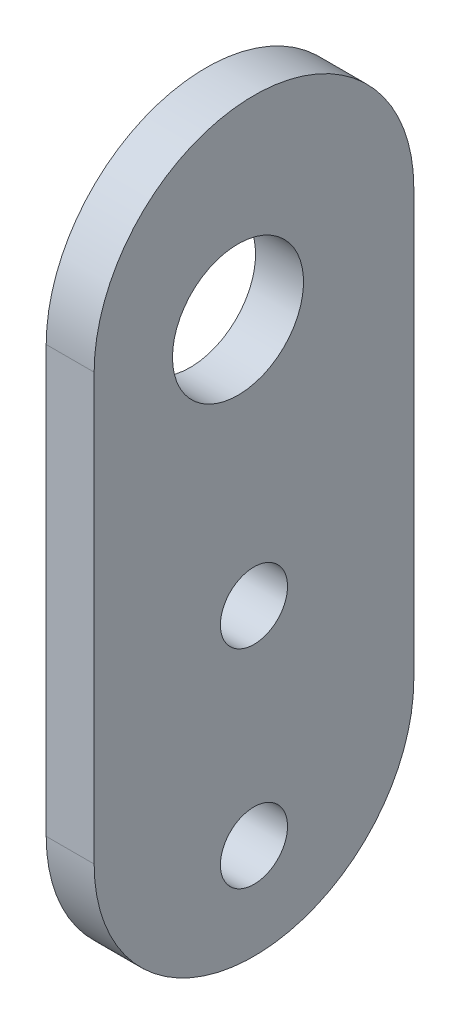
ISO-10303-21;
HEADER;
FILE_DESCRIPTION(('STEP AP214'),'2;1');
FILE_NAME('part.step','',(''),(''),'','','');
FILE_SCHEMA(('AUTOMOTIVE_DESIGN { 1 0 10303 214 1 1 1 1 }'));
ENDSEC;
DATA;
#1=APPLICATION_CONTEXT('core data for automotive mechanical design processes');
#2=APPLICATION_PROTOCOL_DEFINITION('international standard','automotive_design',2000,#1);
#3=PRODUCT_CONTEXT('',#1,'mechanical');
#4=PRODUCT('Part','Part','',(#3));
#5=PRODUCT_RELATED_PRODUCT_CATEGORY('part','',(#4));
#6=PRODUCT_DEFINITION_FORMATION('','',#4);
#7=PRODUCT_DEFINITION_CONTEXT('part definition',#1,'design');
#8=PRODUCT_DEFINITION('design','',#6,#7);
#9=PRODUCT_DEFINITION_SHAPE('','',#8);
#10=(LENGTH_UNIT() NAMED_UNIT(*) SI_UNIT(.MILLI.,.METRE.));
#11=(NAMED_UNIT(*) PLANE_ANGLE_UNIT() SI_UNIT($,.RADIAN.));
#12=(NAMED_UNIT(*) SI_UNIT($,.STERADIAN.) SOLID_ANGLE_UNIT());
#13=UNCERTAINTY_MEASURE_WITH_UNIT(LENGTH_MEASURE(1.E-05),#10,'distance_accuracy_value','');
#14=(GEOMETRIC_REPRESENTATION_CONTEXT(3) GLOBAL_UNCERTAINTY_ASSIGNED_CONTEXT((#13)) GLOBAL_UNIT_ASSIGNED_CONTEXT((#10,
#11,#12)) REPRESENTATION_CONTEXT('',''));
#15=CARTESIAN_POINT('',(0.,0.,0.));
#16=DIRECTION('',(0.,0.,1.));
#17=DIRECTION('',(1.,0.,0.));
#18=AXIS2_PLACEMENT_3D('',#15,#16,#17);
#19=CARTESIAN_POINT('',(-126.55,168.0857476665,139.));
#20=DIRECTION('',(1.,0.,0.));
#21=DIRECTION('',(0.,0.,-1.));
#22=AXIS2_PLACEMENT_3D('',#19,#20,#21);
#23=PLANE('',#22);
#24=CARTESIAN_POINT('',(-126.55,119.0857476665,138.));
#25=DIRECTION('',(-1.,0.,0.));
#26=DIRECTION('',(0.,0.,1.));
#27=AXIS2_PLACEMENT_3D('',#24,#25,#26);
#28=CIRCLE('',#27,2.09999999999999);
#29=CARTESIAN_POINT('',(-126.55,119.0857476665,140.1));
#30=VERTEX_POINT('',#29);
#31=EDGE_CURVE('E94',#30,#30,#28,.F.);
#32=ORIENTED_EDGE('',*,*,#31,.T.);
#33=EDGE_LOOP('',(#32));
#34=FACE_BOUND('',#33,.T.);
#35=CARTESIAN_POINT('',(-126.55,132.0857476665,138.));
#36=DIRECTION('',(-1.,0.,0.));
#37=DIRECTION('',(0.,0.,1.));
#38=AXIS2_PLACEMENT_3D('',#35,#36,#37);
#39=CIRCLE('',#38,2.09999999999999);
#40=CARTESIAN_POINT('',(-126.55,132.0857476665,140.1));
#41=VERTEX_POINT('',#40);
#42=EDGE_CURVE('E97',#41,#41,#39,.F.);
#43=ORIENTED_EDGE('',*,*,#42,.T.);
#44=EDGE_LOOP('',(#43));
#45=FACE_BOUND('',#44,.T.);
#46=CARTESIAN_POINT('',(-126.55,148.0857476665,139.));
#47=DIRECTION('',(-1.,0.,0.));
#48=DIRECTION('',(0.,0.,1.));
#49=AXIS2_PLACEMENT_3D('',#46,#47,#48);
#50=CIRCLE('',#49,4.09999999999999);
#51=CARTESIAN_POINT('',(-126.55,148.0857476665,143.1));
#52=VERTEX_POINT('',#51);
#53=EDGE_CURVE('E70',#52,#52,#50,.F.);
#54=ORIENTED_EDGE('',*,*,#53,.T.);
#55=EDGE_LOOP('',(#54));
#56=FACE_BOUND('',#55,.T.);
#57=DIRECTION('',(0.,1.,0.));
#58=VECTOR('',#57,1.);
#59=CARTESIAN_POINT('',(-126.55,195.9043807818,128.));
#60=LINE('',#59,#58);
#61=CARTESIAN_POINT('',(-126.55,149.7357476665,128.));
#62=VERTEX_POINT('',#61);
#63=CARTESIAN_POINT('',(-126.55,123.0857476665,128.));
#64=VERTEX_POINT('',#63);
#65=EDGE_CURVE('E58',#62,#64,#60,.F.);
#66=ORIENTED_EDGE('',*,*,#65,.T.);
#67=CARTESIAN_POINT('',(-126.55,123.0857476665,138.));
#68=DIRECTION('',(1.,0.,0.));
#69=DIRECTION('',(0.,0.,-1.));
#70=AXIS2_PLACEMENT_3D('',#67,#68,#69);
#71=CIRCLE('',#70,10.);
#72=CARTESIAN_POINT('',(-126.55,123.0857476665,148.));
#73=VERTEX_POINT('',#72);
#74=EDGE_CURVE('E77',#73,#64,#71,.T.);
#75=ORIENTED_EDGE('',*,*,#74,.F.);
#76=DIRECTION('',(0.,1.,0.));
#77=VECTOR('',#76,1.);
#78=CARTESIAN_POINT('',(-126.55,107.4054732291,148.));
#79=LINE('',#78,#77);
#80=CARTESIAN_POINT('',(-126.55,149.7357476665,148.));
#81=VERTEX_POINT('',#80);
#82=EDGE_CURVE('E60',#73,#81,#79,.T.);
#83=ORIENTED_EDGE('',*,*,#82,.T.);
#84=CARTESIAN_POINT('',(-126.55,149.7357476665,138.));
#85=DIRECTION('',(-1.,0.,0.));
#86=DIRECTION('',(0.,0.,1.));
#87=AXIS2_PLACEMENT_3D('',#84,#85,#86);
#88=CIRCLE('',#87,10.);
#89=EDGE_CURVE('E20',#62,#81,#88,.F.);
#90=ORIENTED_EDGE('',*,*,#89,.F.);
#91=EDGE_LOOP('',(#66,#75,#83,#90));
#92=FACE_BOUND('',#91,.T.);
#93=ADVANCED_FACE('F17',(#34,#45,#56,#92),#23,.F.);
#94=CARTESIAN_POINT('',(-117.032,149.7357476665,138.));
#95=DIRECTION('',(-1.,0.,0.));
#96=DIRECTION('',(0.,0.,1.));
#97=AXIS2_PLACEMENT_3D('',#94,#95,#96);
#98=CYLINDRICAL_SURFACE('',#97,10.);
#99=ORIENTED_EDGE('',*,*,#89,.T.);
#100=DIRECTION('',(-1.,0.,0.));
#101=VECTOR('',#100,1.);
#102=CARTESIAN_POINT('',(-123.55,149.7357476665,148.));
#103=LINE('',#102,#101);
#104=CARTESIAN_POINT('',(-123.55,149.7357476665,148.));
#105=VERTEX_POINT('',#104);
#106=EDGE_CURVE('E81',#81,#105,#103,.F.);
#107=ORIENTED_EDGE('',*,*,#106,.T.);
#108=CARTESIAN_POINT('',(-123.55,149.7357476665,138.));
#109=DIRECTION('',(-1.,0.,0.));
#110=DIRECTION('',(0.,0.,1.));
#111=AXIS2_PLACEMENT_3D('',#108,#109,#110);
#112=CIRCLE('',#111,10.);
#113=CARTESIAN_POINT('',(-123.55,149.7357476665,128.));
#114=VERTEX_POINT('',#113);
#115=EDGE_CURVE('E67',#114,#105,#112,.F.);
#116=ORIENTED_EDGE('',*,*,#115,.F.);
#117=DIRECTION('',(1.,0.,0.));
#118=VECTOR('',#117,1.);
#119=CARTESIAN_POINT('',(-123.55,149.7357476665,128.));
#120=LINE('',#119,#118);
#121=EDGE_CURVE('E64',#114,#62,#120,.F.);
#122=ORIENTED_EDGE('',*,*,#121,.T.);
#123=EDGE_LOOP('',(#99,#107,#116,#122));
#124=FACE_BOUND('',#123,.T.);
#125=ADVANCED_FACE('F65',(#124),#98,.T.);
#126=CARTESIAN_POINT('',(-123.55,107.4054732291,148.));
#127=DIRECTION('',(0.,0.,-1.));
#128=DIRECTION('',(-1.,0.,0.));
#129=AXIS2_PLACEMENT_3D('',#126,#127,#128);
#130=PLANE('',#129);
#131=ORIENTED_EDGE('',*,*,#82,.F.);
#132=DIRECTION('',(1.,0.,0.));
#133=VECTOR('',#132,1.);
#134=CARTESIAN_POINT('',(-135.068,123.0857476665,148.));
#135=LINE('',#134,#133);
#136=CARTESIAN_POINT('',(-123.55,123.0857476665,148.));
#137=VERTEX_POINT('',#136);
#138=EDGE_CURVE('E73',#137,#73,#135,.F.);
#139=ORIENTED_EDGE('',*,*,#138,.F.);
#140=DIRECTION('',(0.,1.,0.));
#141=VECTOR('',#140,1.);
#142=CARTESIAN_POINT('',(-123.55,168.0857476665,148.));
#143=LINE('',#142,#141);
#144=EDGE_CURVE('E92',#105,#137,#143,.F.);
#145=ORIENTED_EDGE('',*,*,#144,.F.);
#146=ORIENTED_EDGE('',*,*,#106,.F.);
#147=EDGE_LOOP('',(#131,#139,#145,#146));
#148=FACE_BOUND('',#147,.T.);
#149=ADVANCED_FACE('F104',(#148),#130,.F.);
#150=CARTESIAN_POINT('',(-135.068,123.0857476665,138.));
#151=DIRECTION('',(1.,0.,0.));
#152=DIRECTION('',(0.,0.,-1.));
#153=AXIS2_PLACEMENT_3D('',#150,#151,#152);
#154=CYLINDRICAL_SURFACE('',#153,10.);
#155=CARTESIAN_POINT('',(-123.55,123.0857476665,138.));
#156=DIRECTION('',(1.,0.,0.));
#157=DIRECTION('',(0.,0.,-1.));
#158=AXIS2_PLACEMENT_3D('',#155,#156,#157);
#159=CIRCLE('',#158,10.);
#160=CARTESIAN_POINT('',(-123.55,123.0857476665,128.));
#161=VERTEX_POINT('',#160);
#162=EDGE_CURVE('E89',#137,#161,#159,.T.);
#163=ORIENTED_EDGE('',*,*,#162,.F.);
#164=ORIENTED_EDGE('',*,*,#138,.T.);
#165=ORIENTED_EDGE('',*,*,#74,.T.);
#166=DIRECTION('',(1.,0.,0.));
#167=VECTOR('',#166,1.);
#168=CARTESIAN_POINT('',(-123.55,123.0857476665,128.));
#169=LINE('',#168,#167);
#170=EDGE_CURVE('E35',#64,#161,#169,.T.);
#171=ORIENTED_EDGE('',*,*,#170,.T.);
#172=EDGE_LOOP('',(#163,#164,#165,#171));
#173=FACE_BOUND('',#172,.T.);
#174=ADVANCED_FACE('F109',(#173),#154,.T.);
#175=CARTESIAN_POINT('',(-123.55,195.9043807818,128.));
#176=DIRECTION('',(0.,0.,1.));
#177=DIRECTION('',(1.,0.,0.));
#178=AXIS2_PLACEMENT_3D('',#175,#176,#177);
#179=PLANE('',#178);
#180=DIRECTION('',(0.,1.,0.));
#181=VECTOR('',#180,1.);
#182=CARTESIAN_POINT('',(-123.55,168.0857476665,128.));
#183=LINE('',#182,#181);
#184=EDGE_CURVE('E88',#161,#114,#183,.T.);
#185=ORIENTED_EDGE('',*,*,#184,.F.);
#186=ORIENTED_EDGE('',*,*,#170,.F.);
#187=ORIENTED_EDGE('',*,*,#65,.F.);
#188=ORIENTED_EDGE('',*,*,#121,.F.);
#189=EDGE_LOOP('',(#185,#186,#187,#188));
#190=FACE_BOUND('',#189,.T.);
#191=ADVANCED_FACE('F72',(#190),#179,.F.);
#192=CARTESIAN_POINT('',(-128.55,148.0857476665,139.));
#193=DIRECTION('',(-1.,0.,0.));
#194=DIRECTION('',(0.,0.,1.));
#195=AXIS2_PLACEMENT_3D('',#192,#193,#194);
#196=CYLINDRICAL_SURFACE('',#195,4.09999999999999);
#197=CARTESIAN_POINT('',(-123.55,148.0857476665,139.));
#198=DIRECTION('',(-1.,0.,0.));
#199=DIRECTION('',(0.,0.,1.));
#200=AXIS2_PLACEMENT_3D('',#197,#198,#199);
#201=CIRCLE('',#200,4.09999999999999);
#202=CARTESIAN_POINT('',(-123.55,148.0857476665,143.1));
#203=VERTEX_POINT('',#202);
#204=EDGE_CURVE('E85',#203,#203,#201,.T.);
#205=ORIENTED_EDGE('',*,*,#204,.F.);
#206=EDGE_LOOP('',(#205));
#207=FACE_BOUND('',#206,.T.);
#208=ORIENTED_EDGE('',*,*,#53,.F.);
#209=EDGE_LOOP('',(#208));
#210=FACE_BOUND('',#209,.T.);
#211=ADVANCED_FACE('F117',(#207,#210),#196,.F.);
#212=CARTESIAN_POINT('',(-128.55,132.0857476665,138.));
#213=DIRECTION('',(-1.,0.,0.));
#214=DIRECTION('',(0.,0.,1.));
#215=AXIS2_PLACEMENT_3D('',#212,#213,#214);
#216=CYLINDRICAL_SURFACE('',#215,2.09999999999999);
#217=CARTESIAN_POINT('',(-123.55,132.0857476665,138.));
#218=DIRECTION('',(-1.,0.,0.));
#219=DIRECTION('',(0.,0.,1.));
#220=AXIS2_PLACEMENT_3D('',#217,#218,#219);
#221=CIRCLE('',#220,2.09999999999999);
#222=CARTESIAN_POINT('',(-123.55,132.0857476665,140.1));
#223=VERTEX_POINT('',#222);
#224=EDGE_CURVE('E26',#223,#223,#221,.T.);
#225=ORIENTED_EDGE('',*,*,#224,.F.);
#226=EDGE_LOOP('',(#225));
#227=FACE_BOUND('',#226,.T.);
#228=ORIENTED_EDGE('',*,*,#42,.F.);
#229=EDGE_LOOP('',(#228));
#230=FACE_BOUND('',#229,.T.);
#231=ADVANCED_FACE('F127',(#227,#230),#216,.F.);
#232=CARTESIAN_POINT('',(-128.55,119.0857476665,138.));
#233=DIRECTION('',(-1.,0.,0.));
#234=DIRECTION('',(0.,0.,1.));
#235=AXIS2_PLACEMENT_3D('',#232,#233,#234);
#236=CYLINDRICAL_SURFACE('',#235,2.09999999999999);
#237=CARTESIAN_POINT('',(-123.55,119.0857476665,138.));
#238=DIRECTION('',(-1.,0.,0.));
#239=DIRECTION('',(0.,0.,1.));
#240=AXIS2_PLACEMENT_3D('',#237,#238,#239);
#241=CIRCLE('',#240,2.09999999999999);
#242=CARTESIAN_POINT('',(-123.55,119.0857476665,140.1));
#243=VERTEX_POINT('',#242);
#244=EDGE_CURVE('E10',#243,#243,#241,.T.);
#245=ORIENTED_EDGE('',*,*,#244,.F.);
#246=EDGE_LOOP('',(#245));
#247=FACE_BOUND('',#246,.T.);
#248=ORIENTED_EDGE('',*,*,#31,.F.);
#249=EDGE_LOOP('',(#248));
#250=FACE_BOUND('',#249,.T.);
#251=ADVANCED_FACE('F121',(#247,#250),#236,.F.);
#252=CARTESIAN_POINT('',(-123.55,168.0857476665,139.));
#253=DIRECTION('',(1.,0.,0.));
#254=DIRECTION('',(0.,0.,-1.));
#255=AXIS2_PLACEMENT_3D('',#252,#253,#254);
#256=PLANE('',#255);
#257=ORIENTED_EDGE('',*,*,#244,.T.);
#258=EDGE_LOOP('',(#257));
#259=FACE_BOUND('',#258,.T.);
#260=ORIENTED_EDGE('',*,*,#224,.T.);
#261=EDGE_LOOP('',(#260));
#262=FACE_BOUND('',#261,.T.);
#263=ORIENTED_EDGE('',*,*,#204,.T.);
#264=EDGE_LOOP('',(#263));
#265=FACE_BOUND('',#264,.T.);
#266=ORIENTED_EDGE('',*,*,#162,.T.);
#267=ORIENTED_EDGE('',*,*,#184,.T.);
#268=ORIENTED_EDGE('',*,*,#115,.T.);
#269=ORIENTED_EDGE('',*,*,#144,.T.);
#270=EDGE_LOOP('',(#266,#267,#268,#269));
#271=FACE_BOUND('',#270,.T.);
#272=ADVANCED_FACE('F107',(#259,#262,#265,#271),#256,.T.);
#273=CLOSED_SHELL('',(#93,#125,#149,#174,#191,#211,#231,#251,#272));
#274=MANIFOLD_SOLID_BREP('B1',#273);
#275=ADVANCED_BREP_SHAPE_REPRESENTATION('',(#18,#274),#14);
#276=SHAPE_DEFINITION_REPRESENTATION(#9,#275);
ENDSEC;
END-ISO-10303-21;
